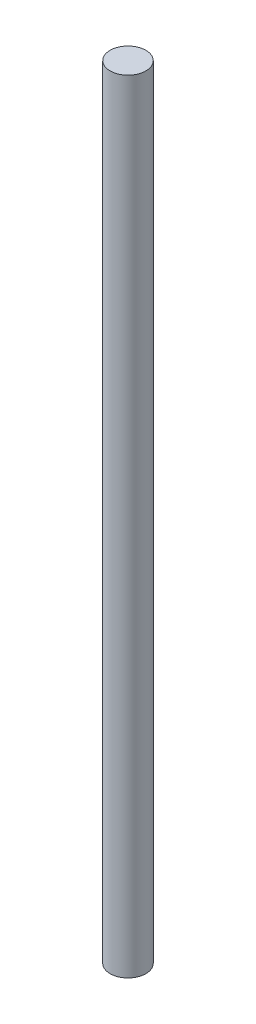
ISO-10303-21;
HEADER;
FILE_DESCRIPTION(('STEP AP214'),'2;1');
FILE_NAME('part.step','',(''),(''),'','','');
FILE_SCHEMA(('AUTOMOTIVE_DESIGN { 1 0 10303 214 1 1 1 1 }'));
ENDSEC;
DATA;
#1=APPLICATION_CONTEXT('core data for automotive mechanical design processes');
#2=APPLICATION_PROTOCOL_DEFINITION('international standard','automotive_design',2000,#1);
#3=PRODUCT_CONTEXT('',#1,'mechanical');
#4=PRODUCT('Part','Part','',(#3));
#5=PRODUCT_RELATED_PRODUCT_CATEGORY('part','',(#4));
#6=PRODUCT_DEFINITION_FORMATION('','',#4);
#7=PRODUCT_DEFINITION_CONTEXT('part definition',#1,'design');
#8=PRODUCT_DEFINITION('design','',#6,#7);
#9=PRODUCT_DEFINITION_SHAPE('','',#8);
#10=(LENGTH_UNIT() NAMED_UNIT(*) SI_UNIT(.MILLI.,.METRE.));
#11=(NAMED_UNIT(*) PLANE_ANGLE_UNIT() SI_UNIT($,.RADIAN.));
#12=(NAMED_UNIT(*) SI_UNIT($,.STERADIAN.) SOLID_ANGLE_UNIT());
#13=UNCERTAINTY_MEASURE_WITH_UNIT(LENGTH_MEASURE(1.E-05),#10,'distance_accuracy_value','');
#14=(GEOMETRIC_REPRESENTATION_CONTEXT(3) GLOBAL_UNCERTAINTY_ASSIGNED_CONTEXT((#13)) GLOBAL_UNIT_ASSIGNED_CONTEXT((#10,
#11,#12)) REPRESENTATION_CONTEXT('',''));
#15=CARTESIAN_POINT('',(0.,0.,0.));
#16=DIRECTION('',(0.,0.,1.));
#17=DIRECTION('',(1.,0.,0.));
#18=AXIS2_PLACEMENT_3D('',#15,#16,#17);
#19=CARTESIAN_POINT('',(0.,175.,0.));
#20=DIRECTION('',(0.,-1.,0.));
#21=DIRECTION('',(0.,0.,-1.));
#22=AXIS2_PLACEMENT_3D('',#19,#20,#21);
#23=CYLINDRICAL_SURFACE('',#22,4.);
#24=CARTESIAN_POINT('',(0.,175.,0.));
#25=DIRECTION('',(0.,1.,0.));
#26=DIRECTION('',(0.,0.,1.));
#27=AXIS2_PLACEMENT_3D('',#24,#25,#26);
#28=CIRCLE('',#27,4.);
#29=CARTESIAN_POINT('',(0.,175.,4.));
#30=VERTEX_POINT('',#29);
#31=EDGE_CURVE('E10',#30,#30,#28,.T.);
#32=ORIENTED_EDGE('',*,*,#31,.F.);
#33=EDGE_LOOP('',(#32));
#34=FACE_BOUND('',#33,.T.);
#35=CARTESIAN_POINT('',(0.,0.,0.));
#36=DIRECTION('',(0.,1.,0.));
#37=DIRECTION('',(0.,0.,1.));
#38=AXIS2_PLACEMENT_3D('',#35,#36,#37);
#39=CIRCLE('',#38,4.);
#40=CARTESIAN_POINT('',(0.,0.,4.));
#41=VERTEX_POINT('',#40);
#42=EDGE_CURVE('E46',#41,#41,#39,.T.);
#43=ORIENTED_EDGE('',*,*,#42,.T.);
#44=EDGE_LOOP('',(#43));
#45=FACE_BOUND('',#44,.T.);
#46=ADVANCED_FACE('F43',(#34,#45),#23,.T.);
#47=CARTESIAN_POINT('',(0.,175.,0.));
#48=DIRECTION('',(0.,1.,0.));
#49=DIRECTION('',(0.,0.,1.));
#50=AXIS2_PLACEMENT_3D('',#47,#48,#49);
#51=PLANE('',#50);
#52=ORIENTED_EDGE('',*,*,#31,.T.);
#53=EDGE_LOOP('',(#52));
#54=FACE_BOUND('',#53,.T.);
#55=ADVANCED_FACE('F58',(#54),#51,.T.);
#56=CARTESIAN_POINT('',(0.,0.,0.));
#57=DIRECTION('',(0.,1.,0.));
#58=DIRECTION('',(0.,0.,1.));
#59=AXIS2_PLACEMENT_3D('',#56,#57,#58);
#60=PLANE('',#59);
#61=ORIENTED_EDGE('',*,*,#42,.F.);
#62=EDGE_LOOP('',(#61));
#63=FACE_BOUND('',#62,.T.);
#64=ADVANCED_FACE('F56',(#63),#60,.F.);
#65=CLOSED_SHELL('',(#46,#55,#64));
#66=MANIFOLD_SOLID_BREP('B2',#65);
#67=ADVANCED_BREP_SHAPE_REPRESENTATION('',(#18,#66),#14);
#68=SHAPE_DEFINITION_REPRESENTATION(#9,#67);
ENDSEC;
END-ISO-10303-21;
